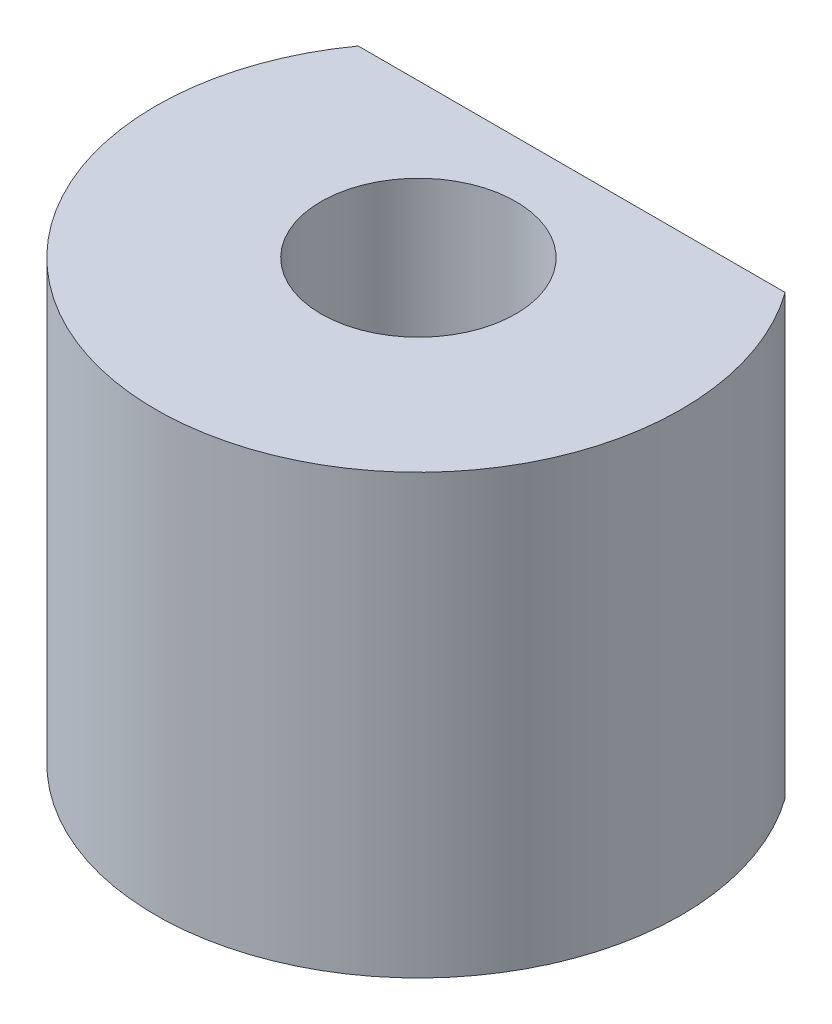
ISO-10303-21;
HEADER;
FILE_DESCRIPTION(('STEP AP214'),'2;1');
FILE_NAME('part.step','',(''),(''),'','','');
FILE_SCHEMA(('AUTOMOTIVE_DESIGN { 1 0 10303 214 1 1 1 1 }'));
ENDSEC;
DATA;
#1=APPLICATION_CONTEXT('core data for automotive mechanical design processes');
#2=APPLICATION_PROTOCOL_DEFINITION('international standard','automotive_design',2000,#1);
#3=PRODUCT_CONTEXT('',#1,'mechanical');
#4=PRODUCT('Part','Part','',(#3));
#5=PRODUCT_RELATED_PRODUCT_CATEGORY('part','',(#4));
#6=PRODUCT_DEFINITION_FORMATION('','',#4);
#7=PRODUCT_DEFINITION_CONTEXT('part definition',#1,'design');
#8=PRODUCT_DEFINITION('design','',#6,#7);
#9=PRODUCT_DEFINITION_SHAPE('','',#8);
#10=(LENGTH_UNIT() NAMED_UNIT(*) SI_UNIT(.MILLI.,.METRE.));
#11=(NAMED_UNIT(*) PLANE_ANGLE_UNIT() SI_UNIT($,.RADIAN.));
#12=(NAMED_UNIT(*) SI_UNIT($,.STERADIAN.) SOLID_ANGLE_UNIT());
#13=UNCERTAINTY_MEASURE_WITH_UNIT(LENGTH_MEASURE(1.E-05),#10,'distance_accuracy_value','');
#14=(GEOMETRIC_REPRESENTATION_CONTEXT(3) GLOBAL_UNCERTAINTY_ASSIGNED_CONTEXT((#13)) GLOBAL_UNIT_ASSIGNED_CONTEXT((#10,
#11,#12)) REPRESENTATION_CONTEXT('',''));
#15=CARTESIAN_POINT('',(0.,0.,0.));
#16=DIRECTION('',(0.,0.,1.));
#17=DIRECTION('',(1.,0.,0.));
#18=AXIS2_PLACEMENT_3D('',#15,#16,#17);
#19=CARTESIAN_POINT('',(0.,10.,0.));
#20=DIRECTION('',(0.,-1.,0.));
#21=DIRECTION('',(0.,0.,-1.));
#22=AXIS2_PLACEMENT_3D('',#19,#20,#21);
#23=CYLINDRICAL_SURFACE('',#22,6.);
#24=CARTESIAN_POINT('',(0.,0.,0.));
#25=DIRECTION('',(0.,1.,0.));
#26=DIRECTION('',(0.,0.,1.));
#27=AXIS2_PLACEMENT_3D('',#24,#25,#26);
#28=CIRCLE('',#27,6.);
#29=CARTESIAN_POINT('',(-4.87339717240448,0.,-3.5));
#30=VERTEX_POINT('',#29);
#31=CARTESIAN_POINT('',(4.87339717240448,0.,-3.5));
#32=VERTEX_POINT('',#31);
#33=EDGE_CURVE('E72',#30,#32,#28,.T.);
#34=ORIENTED_EDGE('',*,*,#33,.T.);
#35=DIRECTION('',(0.,-1.,0.));
#36=VECTOR('',#35,1.);
#37=CARTESIAN_POINT('',(4.87339717240448,10.,-3.5));
#38=LINE('',#37,#36);
#39=CARTESIAN_POINT('',(4.87339717240448,10.,-3.5));
#40=VERTEX_POINT('',#39);
#41=EDGE_CURVE('E11',#40,#32,#38,.T.);
#42=ORIENTED_EDGE('',*,*,#41,.F.);
#43=CARTESIAN_POINT('',(0.,10.,0.));
#44=DIRECTION('',(0.,1.,0.));
#45=DIRECTION('',(0.,0.,1.));
#46=AXIS2_PLACEMENT_3D('',#43,#44,#45);
#47=CIRCLE('',#46,6.);
#48=CARTESIAN_POINT('',(-4.87339717240448,10.,-3.5));
#49=VERTEX_POINT('',#48);
#50=EDGE_CURVE('E74',#49,#40,#47,.T.);
#51=ORIENTED_EDGE('',*,*,#50,.F.);
#52=DIRECTION('',(0.,-1.,0.));
#53=VECTOR('',#52,1.);
#54=CARTESIAN_POINT('',(-4.87339717240448,10.,-3.5));
#55=LINE('',#54,#53);
#56=EDGE_CURVE('E56',#49,#30,#55,.T.);
#57=ORIENTED_EDGE('',*,*,#56,.T.);
#58=EDGE_LOOP('',(#34,#42,#51,#57));
#59=FACE_BOUND('',#58,.T.);
#60=ADVANCED_FACE('F46',(#59),#23,.T.);
#61=CARTESIAN_POINT('',(0.,10.,0.));
#62=DIRECTION('',(0.,-1.,0.));
#63=DIRECTION('',(0.,0.,-1.));
#64=AXIS2_PLACEMENT_3D('',#61,#62,#63);
#65=CYLINDRICAL_SURFACE('',#64,2.2237604307034);
#66=CARTESIAN_POINT('',(0.,10.,0.));
#67=DIRECTION('',(0.,1.,0.));
#68=DIRECTION('',(0.,0.,1.));
#69=AXIS2_PLACEMENT_3D('',#66,#67,#68);
#70=CIRCLE('',#69,2.2237604307034);
#71=CARTESIAN_POINT('',(0.,10.,2.2237604307034));
#72=VERTEX_POINT('',#71);
#73=EDGE_CURVE('E86',#72,#72,#70,.T.);
#74=ORIENTED_EDGE('',*,*,#73,.T.);
#75=EDGE_LOOP('',(#74));
#76=FACE_BOUND('',#75,.T.);
#77=CARTESIAN_POINT('',(0.,0.,0.));
#78=DIRECTION('',(0.,1.,0.));
#79=DIRECTION('',(0.,0.,1.));
#80=AXIS2_PLACEMENT_3D('',#77,#78,#79);
#81=CIRCLE('',#80,2.2237604307034);
#82=CARTESIAN_POINT('',(0.,0.,2.2237604307034));
#83=VERTEX_POINT('',#82);
#84=EDGE_CURVE('E82',#83,#83,#81,.T.);
#85=ORIENTED_EDGE('',*,*,#84,.F.);
#86=EDGE_LOOP('',(#85));
#87=FACE_BOUND('',#86,.T.);
#88=ADVANCED_FACE('F48',(#76,#87),#65,.F.);
#89=CARTESIAN_POINT('',(0.,10.,-3.5));
#90=DIRECTION('',(0.,0.,-1.));
#91=DIRECTION('',(-1.,0.,0.));
#92=AXIS2_PLACEMENT_3D('',#89,#90,#91);
#93=PLANE('',#92);
#94=DIRECTION('',(1.,0.,0.));
#95=VECTOR('',#94,1.);
#96=CARTESIAN_POINT('',(0.,0.,-3.5));
#97=LINE('',#96,#95);
#98=EDGE_CURVE('E80',#30,#32,#97,.T.);
#99=ORIENTED_EDGE('',*,*,#98,.F.);
#100=ORIENTED_EDGE('',*,*,#56,.F.);
#101=DIRECTION('',(1.,0.,0.));
#102=VECTOR('',#101,1.);
#103=CARTESIAN_POINT('',(0.,10.,-3.5));
#104=LINE('',#103,#102);
#105=EDGE_CURVE('E77',#49,#40,#104,.T.);
#106=ORIENTED_EDGE('',*,*,#105,.T.);
#107=ORIENTED_EDGE('',*,*,#41,.T.);
#108=EDGE_LOOP('',(#99,#100,#106,#107));
#109=FACE_BOUND('',#108,.T.);
#110=ADVANCED_FACE('F84',(#109),#93,.T.);
#111=CARTESIAN_POINT('',(0.,10.,0.));
#112=DIRECTION('',(0.,1.,0.));
#113=DIRECTION('',(0.,0.,1.));
#114=AXIS2_PLACEMENT_3D('',#111,#112,#113);
#115=PLANE('',#114);
#116=ORIENTED_EDGE('',*,*,#73,.F.);
#117=EDGE_LOOP('',(#116));
#118=FACE_BOUND('',#117,.T.);
#119=ORIENTED_EDGE('',*,*,#50,.T.);
#120=ORIENTED_EDGE('',*,*,#105,.F.);
#121=EDGE_LOOP('',(#119,#120));
#122=FACE_BOUND('',#121,.T.);
#123=ADVANCED_FACE('F99',(#118,#122),#115,.T.);
#124=CARTESIAN_POINT('',(0.,0.,0.));
#125=DIRECTION('',(0.,1.,0.));
#126=DIRECTION('',(0.,0.,1.));
#127=AXIS2_PLACEMENT_3D('',#124,#125,#126);
#128=PLANE('',#127);
#129=ORIENTED_EDGE('',*,*,#84,.T.);
#130=EDGE_LOOP('',(#129));
#131=FACE_BOUND('',#130,.T.);
#132=ORIENTED_EDGE('',*,*,#33,.F.);
#133=ORIENTED_EDGE('',*,*,#98,.T.);
#134=EDGE_LOOP('',(#132,#133));
#135=FACE_BOUND('',#134,.T.);
#136=ADVANCED_FACE('F79',(#131,#135),#128,.F.);
#137=CLOSED_SHELL('',(#60,#88,#110,#123,#136));
#138=MANIFOLD_SOLID_BREP('B2',#137);
#139=ADVANCED_BREP_SHAPE_REPRESENTATION('',(#18,#138),#14);
#140=SHAPE_DEFINITION_REPRESENTATION(#9,#139);
ENDSEC;
END-ISO-10303-21;
